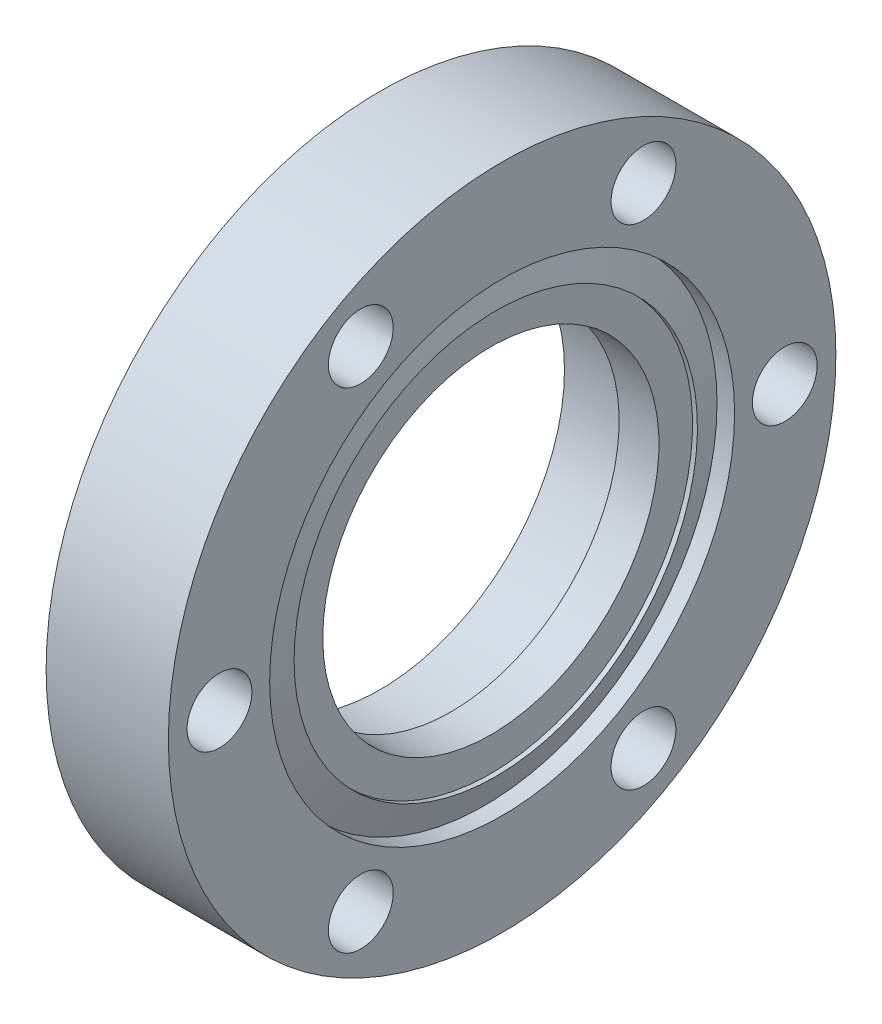
ISO-10303-21;
HEADER;
FILE_DESCRIPTION(('STEP AP214'),'2;1');
FILE_NAME('part.step','',(''),(''),'','','');
FILE_SCHEMA(('AUTOMOTIVE_DESIGN { 1 0 10303 214 1 1 1 1 }'));
ENDSEC;
DATA;
#1=APPLICATION_CONTEXT('core data for automotive mechanical design processes');
#2=APPLICATION_PROTOCOL_DEFINITION('international standard','automotive_design',2000,#1);
#3=PRODUCT_CONTEXT('',#1,'mechanical');
#4=PRODUCT('Part','Part','',(#3));
#5=PRODUCT_RELATED_PRODUCT_CATEGORY('part','',(#4));
#6=PRODUCT_DEFINITION_FORMATION('','',#4);
#7=PRODUCT_DEFINITION_CONTEXT('part definition',#1,'design');
#8=PRODUCT_DEFINITION('design','',#6,#7);
#9=PRODUCT_DEFINITION_SHAPE('','',#8);
#10=(LENGTH_UNIT() NAMED_UNIT(*) SI_UNIT(.MILLI.,.METRE.));
#11=(NAMED_UNIT(*) PLANE_ANGLE_UNIT() SI_UNIT($,.RADIAN.));
#12=(NAMED_UNIT(*) SI_UNIT($,.STERADIAN.) SOLID_ANGLE_UNIT());
#13=UNCERTAINTY_MEASURE_WITH_UNIT(LENGTH_MEASURE(1.E-05),#10,'distance_accuracy_value','');
#14=(GEOMETRIC_REPRESENTATION_CONTEXT(3) GLOBAL_UNCERTAINTY_ASSIGNED_CONTEXT((#13)) GLOBAL_UNIT_ASSIGNED_CONTEXT((#10,
#11,#12)) REPRESENTATION_CONTEXT('',''));
#15=CARTESIAN_POINT('',(0.,0.,0.));
#16=DIRECTION('',(0.,0.,1.));
#17=DIRECTION('',(1.,0.,0.));
#18=AXIS2_PLACEMENT_3D('',#15,#16,#17);
#19=CARTESIAN_POINT('',(5.18000000000051,-19.2062500000005,0.));
#20=DIRECTION('',(1.,0.,0.));
#21=DIRECTION('',(0.,0.,-1.));
#22=AXIS2_PLACEMENT_3D('',#19,#20,#21);
#23=PLANE('',#22);
#24=CARTESIAN_POINT('',(5.18000000000051,0.,0.));
#25=DIRECTION('',(-1.,0.,0.));
#26=DIRECTION('',(0.,0.,1.));
#27=AXIS2_PLACEMENT_3D('',#24,#25,#26);
#28=CIRCLE('',#27,17.4625);
#29=CARTESIAN_POINT('',(5.18000000000051,0.,17.4625));
#30=VERTEX_POINT('',#29);
#31=EDGE_CURVE('E19',#30,#30,#28,.T.);
#32=ORIENTED_EDGE('',*,*,#31,.T.);
#33=EDGE_LOOP('',(#32));
#34=FACE_BOUND('',#33,.T.);
#35=CARTESIAN_POINT('',(5.18000000000051,0.,0.));
#36=DIRECTION('',(-1.,0.,0.));
#37=DIRECTION('',(0.,0.,1.));
#38=AXIS2_PLACEMENT_3D('',#35,#36,#37);
#39=CIRCLE('',#38,20.950000000001);
#40=CARTESIAN_POINT('',(5.18000000000051,0.,20.950000000001));
#41=VERTEX_POINT('',#40);
#42=EDGE_CURVE('E82',#41,#41,#39,.F.);
#43=ORIENTED_EDGE('',*,*,#42,.T.);
#44=EDGE_LOOP('',(#43));
#45=FACE_BOUND('',#44,.T.);
#46=ADVANCED_FACE('F15',(#34,#45),#23,.T.);
#47=CARTESIAN_POINT('',(3.11069999999995,0.,0.));
#48=DIRECTION('',(-1.,0.,0.));
#49=DIRECTION('',(0.,0.,1.));
#50=AXIS2_PLACEMENT_3D('',#47,#48,#49);
#51=CYLINDRICAL_SURFACE('',#50,17.4625);
#52=CARTESIAN_POINT('',(1.04139999999939,0.,0.));
#53=DIRECTION('',(-1.,0.,0.));
#54=DIRECTION('',(0.,0.,1.));
#55=AXIS2_PLACEMENT_3D('',#52,#53,#54);
#56=CIRCLE('',#55,17.4625);
#57=CARTESIAN_POINT('',(1.04139999999939,0.,17.4625));
#58=VERTEX_POINT('',#57);
#59=EDGE_CURVE('E80',#58,#58,#56,.F.);
#60=ORIENTED_EDGE('',*,*,#59,.F.);
#61=EDGE_LOOP('',(#60));
#62=FACE_BOUND('',#61,.T.);
#63=ORIENTED_EDGE('',*,*,#31,.F.);
#64=EDGE_LOOP('',(#63));
#65=FACE_BOUND('',#64,.T.);
#66=ADVANCED_FACE('F90',(#62,#65),#51,.F.);
#67=CARTESIAN_POINT('',(5.43499999999988,0.,0.));
#68=DIRECTION('',(-1.,0.,0.));
#69=DIRECTION('',(0.,0.,1.));
#70=AXIS2_PLACEMENT_3D('',#67,#68,#69);
#71=CYLINDRICAL_SURFACE('',#70,20.950000000001);
#72=ORIENTED_EDGE('',*,*,#42,.F.);
#73=EDGE_LOOP('',(#72));
#74=FACE_BOUND('',#73,.T.);
#75=CARTESIAN_POINT('',(5.69000000223288,0.,0.));
#76=DIRECTION('',(-1.,0.,0.));
#77=DIRECTION('',(0.,-1.,0.));
#78=AXIS2_PLACEMENT_3D('',#75,#76,#77);
#79=CIRCLE('',#78,20.950000000814);
#80=CARTESIAN_POINT('',(5.69000000223288,-20.950000000814,0.));
#81=VERTEX_POINT('',#80);
#82=EDGE_CURVE('E79',#81,#81,#79,.T.);
#83=ORIENTED_EDGE('',*,*,#82,.F.);
#84=EDGE_LOOP('',(#83));
#85=FACE_BOUND('',#84,.T.);
#86=ADVANCED_FACE('F92',(#74,#85),#71,.F.);
#87=CARTESIAN_POINT('',(1.04139999999939,-18.3197499999999,0.));
#88=DIRECTION('',(-1.,0.,0.));
#89=DIRECTION('',(0.,0.,1.));
#90=AXIS2_PLACEMENT_3D('',#87,#88,#89);
#91=PLANE('',#90);
#92=ORIENTED_EDGE('',*,*,#59,.T.);
#93=EDGE_LOOP('',(#92));
#94=FACE_BOUND('',#93,.T.);
#95=CARTESIAN_POINT('',(1.04139999999939,0.,0.));
#96=DIRECTION('',(-1.,0.,0.));
#97=DIRECTION('',(0.,0.,1.));
#98=AXIS2_PLACEMENT_3D('',#95,#96,#97);
#99=CIRCLE('',#98,19.1769999999999);
#100=CARTESIAN_POINT('',(1.04139999999939,0.,19.1769999999999));
#101=VERTEX_POINT('',#100);
#102=EDGE_CURVE('E76',#101,#101,#99,.T.);
#103=ORIENTED_EDGE('',*,*,#102,.T.);
#104=EDGE_LOOP('',(#103));
#105=FACE_BOUND('',#104,.T.);
#106=ADVANCED_FACE('F100',(#94,#105),#91,.T.);
#107=CARTESIAN_POINT('',(4.52529524811392,0.,0.));
#108=DIRECTION('',(-1.,0.,0.));
#109=DIRECTION('',(0.,0.,1.));
#110=AXIS2_PLACEMENT_3D('',#107,#108,#109);
#111=CONICAL_SURFACE('',#110,24.1499999991873,1.22173047499998);
#112=ORIENTED_EDGE('',*,*,#82,.T.);
#113=EDGE_LOOP('',(#112));
#114=FACE_BOUND('',#113,.T.);
#115=CARTESIAN_POINT('',(4.52529525034756,0.,0.));
#116=DIRECTION('',(-1.,0.,0.));
#117=DIRECTION('',(0.,0.,1.));
#118=AXIS2_PLACEMENT_3D('',#115,#116,#117);
#119=CIRCLE('',#118,24.1500000000003);
#120=CARTESIAN_POINT('',(4.52529525034756,0.,24.1500000000003));
#121=VERTEX_POINT('',#120);
#122=EDGE_CURVE('E75',#121,#121,#119,.F.);
#123=ORIENTED_EDGE('',*,*,#122,.T.);
#124=EDGE_LOOP('',(#123));
#125=FACE_BOUND('',#124,.T.);
#126=ADVANCED_FACE('F128',(#114,#125),#111,.T.);
#127=CARTESIAN_POINT('',(-2.65429999999995,0.,0.));
#128=DIRECTION('',(-1.,0.,0.));
#129=DIRECTION('',(0.,0.,1.));
#130=AXIS2_PLACEMENT_3D('',#127,#128,#129);
#131=CYLINDRICAL_SURFACE('',#130,19.1769999999999);
#132=CARTESIAN_POINT('',(-6.34999999999929,0.,0.));
#133=DIRECTION('',(-1.,0.,0.));
#134=DIRECTION('',(0.,0.,1.));
#135=AXIS2_PLACEMENT_3D('',#132,#133,#134);
#136=CIRCLE('',#135,19.1769999999999);
#137=CARTESIAN_POINT('',(-6.34999999999929,0.,19.1769999999999));
#138=VERTEX_POINT('',#137);
#139=EDGE_CURVE('E54',#138,#138,#136,.F.);
#140=ORIENTED_EDGE('',*,*,#139,.F.);
#141=EDGE_LOOP('',(#140));
#142=FACE_BOUND('',#141,.T.);
#143=ORIENTED_EDGE('',*,*,#102,.F.);
#144=EDGE_LOOP('',(#143));
#145=FACE_BOUND('',#144,.T.);
#146=ADVANCED_FACE('F124',(#142,#145),#131,.F.);
#147=CARTESIAN_POINT('',(6.34999999999939,-25.4285843160799,14.6811999999998));
#148=DIRECTION('',(-1.,0.,0.));
#149=DIRECTION('',(0.,0.,1.));
#150=AXIS2_PLACEMENT_3D('',#147,#148,#149);
#151=CYLINDRICAL_SURFACE('',#150,3.36550000000002);
#152=CARTESIAN_POINT('',(6.34999999999937,-25.4285843160799,14.6811999999998));
#153=DIRECTION('',(-1.,0.,0.));
#154=DIRECTION('',(0.,0.,1.));
#155=AXIS2_PLACEMENT_3D('',#152,#153,#154);
#156=CIRCLE('',#155,3.36550000000002);
#157=CARTESIAN_POINT('',(6.34999999999937,-25.4285843160799,18.0466999999999));
#158=VERTEX_POINT('',#157);
#159=EDGE_CURVE('E51',#158,#158,#156,.T.);
#160=ORIENTED_EDGE('',*,*,#159,.F.);
#161=EDGE_LOOP('',(#160));
#162=FACE_BOUND('',#161,.T.);
#163=CARTESIAN_POINT('',(-6.34999999999929,-25.4285843160799,14.6811999999998));
#164=DIRECTION('',(-1.,0.,0.));
#165=DIRECTION('',(0.,0.,1.));
#166=AXIS2_PLACEMENT_3D('',#163,#164,#165);
#167=CIRCLE('',#166,3.36550000000002);
#168=CARTESIAN_POINT('',(-6.34999999999929,-25.4285843160799,18.0466999999999));
#169=VERTEX_POINT('',#168);
#170=EDGE_CURVE('E72',#169,#169,#167,.F.);
#171=ORIENTED_EDGE('',*,*,#170,.F.);
#172=EDGE_LOOP('',(#171));
#173=FACE_BOUND('',#172,.T.);
#174=ADVANCED_FACE('F127',(#162,#173),#151,.F.);
#175=CARTESIAN_POINT('',(6.34999999999939,0.,29.3623999999996));
#176=DIRECTION('',(-1.,0.,0.));
#177=DIRECTION('',(0.,0.,1.));
#178=AXIS2_PLACEMENT_3D('',#175,#176,#177);
#179=CYLINDRICAL_SURFACE('',#178,3.3655);
#180=CARTESIAN_POINT('',(6.34999999999937,0.,29.3623999999996));
#181=DIRECTION('',(-1.,0.,0.));
#182=DIRECTION('',(0.,0.,1.));
#183=AXIS2_PLACEMENT_3D('',#180,#181,#182);
#184=CIRCLE('',#183,3.3655);
#185=CARTESIAN_POINT('',(6.34999999999937,0.,32.7278999999996));
#186=VERTEX_POINT('',#185);
#187=EDGE_CURVE('E48',#186,#186,#184,.T.);
#188=ORIENTED_EDGE('',*,*,#187,.F.);
#189=EDGE_LOOP('',(#188));
#190=FACE_BOUND('',#189,.T.);
#191=CARTESIAN_POINT('',(-6.34999999999929,0.,29.3623999999996));
#192=DIRECTION('',(-1.,0.,0.));
#193=DIRECTION('',(0.,0.,1.));
#194=AXIS2_PLACEMENT_3D('',#191,#192,#193);
#195=CIRCLE('',#194,3.3655);
#196=CARTESIAN_POINT('',(-6.34999999999929,0.,32.7278999999996));
#197=VERTEX_POINT('',#196);
#198=EDGE_CURVE('E69',#197,#197,#195,.F.);
#199=ORIENTED_EDGE('',*,*,#198,.F.);
#200=EDGE_LOOP('',(#199));
#201=FACE_BOUND('',#200,.T.);
#202=ADVANCED_FACE('F159',(#190,#201),#179,.F.);
#203=CARTESIAN_POINT('',(6.34999999999939,25.4285843160799,14.6811999999998));
#204=DIRECTION('',(-1.,0.,0.));
#205=DIRECTION('',(0.,0.,1.));
#206=AXIS2_PLACEMENT_3D('',#203,#204,#205);
#207=CYLINDRICAL_SURFACE('',#206,3.36549999999999);
#208=CARTESIAN_POINT('',(6.34999999999937,25.4285843160799,14.6811999999998));
#209=DIRECTION('',(-1.,0.,0.));
#210=DIRECTION('',(0.,0.,1.));
#211=AXIS2_PLACEMENT_3D('',#208,#209,#210);
#212=CIRCLE('',#211,3.36549999999999);
#213=CARTESIAN_POINT('',(6.34999999999937,25.4285843160799,18.0466999999998));
#214=VERTEX_POINT('',#213);
#215=EDGE_CURVE('E45',#214,#214,#212,.T.);
#216=ORIENTED_EDGE('',*,*,#215,.F.);
#217=EDGE_LOOP('',(#216));
#218=FACE_BOUND('',#217,.T.);
#219=CARTESIAN_POINT('',(-6.34999999999929,25.4285843160799,14.6811999999998));
#220=DIRECTION('',(-1.,0.,0.));
#221=DIRECTION('',(0.,0.,1.));
#222=AXIS2_PLACEMENT_3D('',#219,#220,#221);
#223=CIRCLE('',#222,3.36549999999999);
#224=CARTESIAN_POINT('',(-6.34999999999929,25.4285843160799,18.0466999999998));
#225=VERTEX_POINT('',#224);
#226=EDGE_CURVE('E66',#225,#225,#223,.F.);
#227=ORIENTED_EDGE('',*,*,#226,.F.);
#228=EDGE_LOOP('',(#227));
#229=FACE_BOUND('',#228,.T.);
#230=ADVANCED_FACE('F167',(#218,#229),#207,.F.);
#231=CARTESIAN_POINT('',(6.34999999999939,25.4285843160799,-14.6811999999998));
#232=DIRECTION('',(-1.,0.,0.));
#233=DIRECTION('',(0.,0.,1.));
#234=AXIS2_PLACEMENT_3D('',#231,#232,#233);
#235=CYLINDRICAL_SURFACE('',#234,3.3655);
#236=CARTESIAN_POINT('',(6.34999999999937,25.4285843160799,-14.6811999999998));
#237=DIRECTION('',(-1.,0.,0.));
#238=DIRECTION('',(0.,0.,1.));
#239=AXIS2_PLACEMENT_3D('',#236,#237,#238);
#240=CIRCLE('',#239,3.3655);
#241=CARTESIAN_POINT('',(6.34999999999937,25.4285843160799,-11.3156999999998));
#242=VERTEX_POINT('',#241);
#243=EDGE_CURVE('E42',#242,#242,#240,.T.);
#244=ORIENTED_EDGE('',*,*,#243,.F.);
#245=EDGE_LOOP('',(#244));
#246=FACE_BOUND('',#245,.T.);
#247=CARTESIAN_POINT('',(-6.34999999999929,25.4285843160799,-14.6811999999998));
#248=DIRECTION('',(-1.,0.,0.));
#249=DIRECTION('',(0.,0.,1.));
#250=AXIS2_PLACEMENT_3D('',#247,#248,#249);
#251=CIRCLE('',#250,3.3655);
#252=CARTESIAN_POINT('',(-6.34999999999929,25.4285843160799,-11.3156999999998));
#253=VERTEX_POINT('',#252);
#254=EDGE_CURVE('E63',#253,#253,#251,.F.);
#255=ORIENTED_EDGE('',*,*,#254,.F.);
#256=EDGE_LOOP('',(#255));
#257=FACE_BOUND('',#256,.T.);
#258=ADVANCED_FACE('F175',(#246,#257),#235,.F.);
#259=CARTESIAN_POINT('',(6.34999999999939,-25.4285843160799,-14.6811999999998));
#260=DIRECTION('',(-1.,0.,0.));
#261=DIRECTION('',(0.,0.,1.));
#262=AXIS2_PLACEMENT_3D('',#259,#260,#261);
#263=CYLINDRICAL_SURFACE('',#262,3.3655);
#264=CARTESIAN_POINT('',(6.34999999999937,-25.4285843160799,-14.6811999999998));
#265=DIRECTION('',(-1.,0.,0.));
#266=DIRECTION('',(0.,0.,1.));
#267=AXIS2_PLACEMENT_3D('',#264,#265,#266);
#268=CIRCLE('',#267,3.3655);
#269=CARTESIAN_POINT('',(6.34999999999937,-25.4285843160799,-11.3156999999998));
#270=VERTEX_POINT('',#269);
#271=EDGE_CURVE('E39',#270,#270,#268,.T.);
#272=ORIENTED_EDGE('',*,*,#271,.F.);
#273=EDGE_LOOP('',(#272));
#274=FACE_BOUND('',#273,.T.);
#275=CARTESIAN_POINT('',(-6.34999999999929,-25.4285843160799,-14.6811999999998));
#276=DIRECTION('',(-1.,0.,0.));
#277=DIRECTION('',(0.,0.,1.));
#278=AXIS2_PLACEMENT_3D('',#275,#276,#277);
#279=CIRCLE('',#278,3.3655);
#280=CARTESIAN_POINT('',(-6.34999999999929,-25.4285843160799,-11.3156999999998));
#281=VERTEX_POINT('',#280);
#282=EDGE_CURVE('E60',#281,#281,#279,.F.);
#283=ORIENTED_EDGE('',*,*,#282,.F.);
#284=EDGE_LOOP('',(#283));
#285=FACE_BOUND('',#284,.T.);
#286=ADVANCED_FACE('F183',(#274,#285),#263,.F.);
#287=CARTESIAN_POINT('',(6.34999999999939,0.,-29.3623999999996));
#288=DIRECTION('',(-1.,0.,0.));
#289=DIRECTION('',(0.,0.,1.));
#290=AXIS2_PLACEMENT_3D('',#287,#288,#289);
#291=CYLINDRICAL_SURFACE('',#290,3.3655);
#292=CARTESIAN_POINT('',(6.34999999999937,0.,-29.3623999999996));
#293=DIRECTION('',(-1.,0.,0.));
#294=DIRECTION('',(0.,0.,1.));
#295=AXIS2_PLACEMENT_3D('',#292,#293,#294);
#296=CIRCLE('',#295,3.3655);
#297=CARTESIAN_POINT('',(6.34999999999937,0.,-25.9968999999996));
#298=VERTEX_POINT('',#297);
#299=EDGE_CURVE('E36',#298,#298,#296,.T.);
#300=ORIENTED_EDGE('',*,*,#299,.F.);
#301=EDGE_LOOP('',(#300));
#302=FACE_BOUND('',#301,.T.);
#303=CARTESIAN_POINT('',(-6.34999999999929,0.,-29.3623999999996));
#304=DIRECTION('',(-1.,0.,0.));
#305=DIRECTION('',(0.,0.,1.));
#306=AXIS2_PLACEMENT_3D('',#303,#304,#305);
#307=CIRCLE('',#306,3.3655);
#308=CARTESIAN_POINT('',(-6.34999999999929,0.,-25.9968999999996));
#309=VERTEX_POINT('',#308);
#310=EDGE_CURVE('E57',#309,#309,#307,.F.);
#311=ORIENTED_EDGE('',*,*,#310,.F.);
#312=EDGE_LOOP('',(#311));
#313=FACE_BOUND('',#312,.T.);
#314=ADVANCED_FACE('F17',(#302,#313),#291,.F.);
#315=CARTESIAN_POINT('',(5.43764762517347,0.,0.));
#316=DIRECTION('',(-1.,0.,0.));
#317=DIRECTION('',(0.,0.,1.));
#318=AXIS2_PLACEMENT_3D('',#315,#316,#317);
#319=CYLINDRICAL_SURFACE('',#318,24.1500000000003);
#320=ORIENTED_EDGE('',*,*,#122,.F.);
#321=EDGE_LOOP('',(#320));
#322=FACE_BOUND('',#321,.T.);
#323=CARTESIAN_POINT('',(6.34999999999937,0.,0.));
#324=DIRECTION('',(-1.,0.,0.));
#325=DIRECTION('',(0.,0.,1.));
#326=AXIS2_PLACEMENT_3D('',#323,#324,#325);
#327=CIRCLE('',#326,24.1500000000003);
#328=CARTESIAN_POINT('',(6.34999999999937,0.,24.1500000000003));
#329=VERTEX_POINT('',#328);
#330=EDGE_CURVE('E28',#329,#329,#327,.T.);
#331=ORIENTED_EDGE('',*,*,#330,.F.);
#332=EDGE_LOOP('',(#331));
#333=FACE_BOUND('',#332,.T.);
#334=ADVANCED_FACE('F119',(#322,#333),#319,.F.);
#335=CARTESIAN_POINT('',(-6.34999999999929,-26.9240000000001,0.));
#336=DIRECTION('',(-1.,0.,0.));
#337=DIRECTION('',(0.,0.,1.));
#338=AXIS2_PLACEMENT_3D('',#335,#336,#337);
#339=PLANE('',#338);
#340=ORIENTED_EDGE('',*,*,#139,.T.);
#341=EDGE_LOOP('',(#340));
#342=FACE_BOUND('',#341,.T.);
#343=ORIENTED_EDGE('',*,*,#310,.T.);
#344=EDGE_LOOP('',(#343));
#345=FACE_BOUND('',#344,.T.);
#346=ORIENTED_EDGE('',*,*,#282,.T.);
#347=EDGE_LOOP('',(#346));
#348=FACE_BOUND('',#347,.T.);
#349=ORIENTED_EDGE('',*,*,#254,.T.);
#350=EDGE_LOOP('',(#349));
#351=FACE_BOUND('',#350,.T.);
#352=ORIENTED_EDGE('',*,*,#226,.T.);
#353=EDGE_LOOP('',(#352));
#354=FACE_BOUND('',#353,.T.);
#355=ORIENTED_EDGE('',*,*,#198,.T.);
#356=EDGE_LOOP('',(#355));
#357=FACE_BOUND('',#356,.T.);
#358=ORIENTED_EDGE('',*,*,#170,.T.);
#359=EDGE_LOOP('',(#358));
#360=FACE_BOUND('',#359,.T.);
#361=CARTESIAN_POINT('',(-6.34999999999929,0.,0.));
#362=DIRECTION('',(-1.,0.,0.));
#363=DIRECTION('',(0.,0.,1.));
#364=AXIS2_PLACEMENT_3D('',#361,#362,#363);
#365=CIRCLE('',#364,34.6710000000003);
#366=CARTESIAN_POINT('',(-6.34999999999929,0.,34.6710000000003));
#367=VERTEX_POINT('',#366);
#368=EDGE_CURVE('E23',#367,#367,#365,.F.);
#369=ORIENTED_EDGE('',*,*,#368,.F.);
#370=EDGE_LOOP('',(#369));
#371=FACE_BOUND('',#370,.T.);
#372=ADVANCED_FACE('F112',(#342,#345,#348,#351,#354,#357,#360,#371),#339,.T.);
#373=CARTESIAN_POINT('',(6.34999999999937,-29.4105000000003,0.));
#374=DIRECTION('',(1.,0.,0.));
#375=DIRECTION('',(0.,0.,-1.));
#376=AXIS2_PLACEMENT_3D('',#373,#374,#375);
#377=PLANE('',#376);
#378=ORIENTED_EDGE('',*,*,#330,.T.);
#379=EDGE_LOOP('',(#378));
#380=FACE_BOUND('',#379,.T.);
#381=ORIENTED_EDGE('',*,*,#299,.T.);
#382=EDGE_LOOP('',(#381));
#383=FACE_BOUND('',#382,.T.);
#384=ORIENTED_EDGE('',*,*,#271,.T.);
#385=EDGE_LOOP('',(#384));
#386=FACE_BOUND('',#385,.T.);
#387=ORIENTED_EDGE('',*,*,#243,.T.);
#388=EDGE_LOOP('',(#387));
#389=FACE_BOUND('',#388,.T.);
#390=ORIENTED_EDGE('',*,*,#215,.T.);
#391=EDGE_LOOP('',(#390));
#392=FACE_BOUND('',#391,.T.);
#393=ORIENTED_EDGE('',*,*,#187,.T.);
#394=EDGE_LOOP('',(#393));
#395=FACE_BOUND('',#394,.T.);
#396=ORIENTED_EDGE('',*,*,#159,.T.);
#397=EDGE_LOOP('',(#396));
#398=FACE_BOUND('',#397,.T.);
#399=CARTESIAN_POINT('',(6.34999999999937,0.,0.));
#400=DIRECTION('',(-1.,0.,0.));
#401=DIRECTION('',(0.,0.,1.));
#402=AXIS2_PLACEMENT_3D('',#399,#400,#401);
#403=CIRCLE('',#402,34.6710000000003);
#404=CARTESIAN_POINT('',(6.34999999999937,0.,34.6710000000003));
#405=VERTEX_POINT('',#404);
#406=EDGE_CURVE('E10',#405,#405,#403,.T.);
#407=ORIENTED_EDGE('',*,*,#406,.F.);
#408=EDGE_LOOP('',(#407));
#409=FACE_BOUND('',#408,.T.);
#410=ADVANCED_FACE('F107',(#380,#383,#386,#389,#392,#395,#398,#409),#377,.T.);
#411=CARTESIAN_POINT('',(0.,0.,0.));
#412=DIRECTION('',(-1.,0.,0.));
#413=DIRECTION('',(0.,0.,1.));
#414=AXIS2_PLACEMENT_3D('',#411,#412,#413);
#415=CYLINDRICAL_SURFACE('',#414,34.6710000000003);
#416=ORIENTED_EDGE('',*,*,#406,.T.);
#417=EDGE_LOOP('',(#416));
#418=FACE_BOUND('',#417,.T.);
#419=ORIENTED_EDGE('',*,*,#368,.T.);
#420=EDGE_LOOP('',(#419));
#421=FACE_BOUND('',#420,.T.);
#422=ADVANCED_FACE('F105',(#418,#421),#415,.T.);
#423=CLOSED_SHELL('',(#46,#66,#86,#106,#126,#146,#174,#202,#230,#258,#286,#314,#334,#372,#410,#422));
#424=MANIFOLD_SOLID_BREP('B1',#423);
#425=ADVANCED_BREP_SHAPE_REPRESENTATION('',(#18,#424),#14);
#426=SHAPE_DEFINITION_REPRESENTATION(#9,#425);
ENDSEC;
END-ISO-10303-21;
